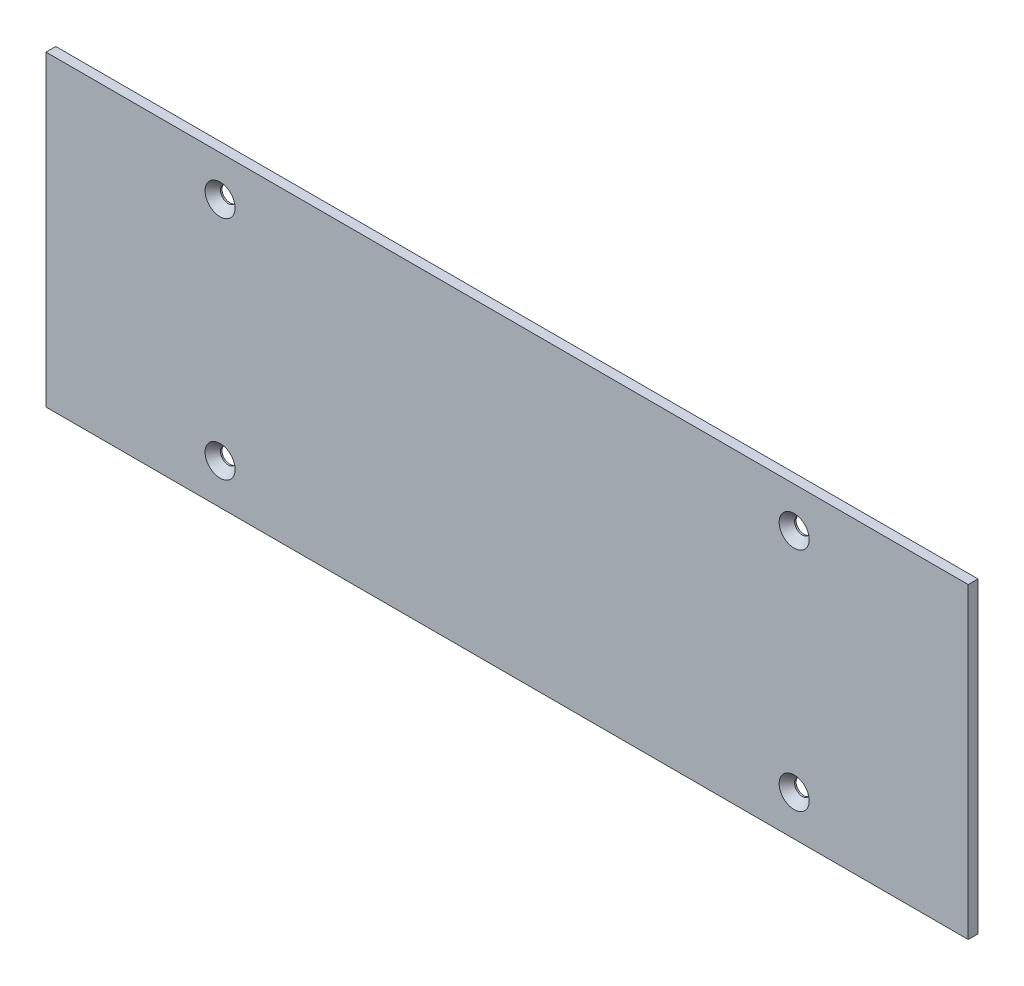
ISO-10303-21;
HEADER;
FILE_DESCRIPTION(('STEP AP214'),'2;1');
FILE_NAME('part.step','',(''),(''),'','','');
FILE_SCHEMA(('AUTOMOTIVE_DESIGN { 1 0 10303 214 1 1 1 1 }'));
ENDSEC;
DATA;
#1=APPLICATION_CONTEXT('core data for automotive mechanical design processes');
#2=APPLICATION_PROTOCOL_DEFINITION('international standard','automotive_design',2000,#1);
#3=PRODUCT_CONTEXT('',#1,'mechanical');
#4=PRODUCT('Part','Part','',(#3));
#5=PRODUCT_RELATED_PRODUCT_CATEGORY('part','',(#4));
#6=PRODUCT_DEFINITION_FORMATION('','',#4);
#7=PRODUCT_DEFINITION_CONTEXT('part definition',#1,'design');
#8=PRODUCT_DEFINITION('design','',#6,#7);
#9=PRODUCT_DEFINITION_SHAPE('','',#8);
#10=(LENGTH_UNIT() NAMED_UNIT(*) SI_UNIT(.MILLI.,.METRE.));
#11=(NAMED_UNIT(*) PLANE_ANGLE_UNIT() SI_UNIT($,.RADIAN.));
#12=(NAMED_UNIT(*) SI_UNIT($,.STERADIAN.) SOLID_ANGLE_UNIT());
#13=UNCERTAINTY_MEASURE_WITH_UNIT(LENGTH_MEASURE(1.E-05),#10,'distance_accuracy_value','');
#14=(GEOMETRIC_REPRESENTATION_CONTEXT(3) GLOBAL_UNCERTAINTY_ASSIGNED_CONTEXT((#13)) GLOBAL_UNIT_ASSIGNED_CONTEXT((#10,
#11,#12)) REPRESENTATION_CONTEXT('',''));
#15=CARTESIAN_POINT('',(0.,0.,0.));
#16=DIRECTION('',(0.,0.,1.));
#17=DIRECTION('',(1.,0.,0.));
#18=AXIS2_PLACEMENT_3D('',#15,#16,#17);
#19=CARTESIAN_POINT('',(149.999999847,-49.999999949,3.175));
#20=DIRECTION('',(-1.,0.,0.));
#21=DIRECTION('',(0.,0.,1.));
#22=AXIS2_PLACEMENT_3D('',#19,#20,#21);
#23=PLANE('',#22);
#24=DIRECTION('',(0.,1.,0.));
#25=VECTOR('',#24,1.);
#26=CARTESIAN_POINT('',(149.999999847,-49.999999949,0.));
#27=LINE('',#26,#25);
#28=CARTESIAN_POINT('',(149.999999847,-49.999999949,0.));
#29=VERTEX_POINT('',#28);
#30=CARTESIAN_POINT('',(149.999999847,49.999999949,0.));
#31=VERTEX_POINT('',#30);
#32=EDGE_CURVE('E105',#29,#31,#27,.T.);
#33=ORIENTED_EDGE('',*,*,#32,.T.);
#34=DIRECTION('',(0.,0.,-1.));
#35=VECTOR('',#34,1.);
#36=CARTESIAN_POINT('',(149.999999847,49.999999949,3.175));
#37=LINE('',#36,#35);
#38=CARTESIAN_POINT('',(149.999999847,49.999999949,3.175));
#39=VERTEX_POINT('',#38);
#40=EDGE_CURVE('E11',#39,#31,#37,.T.);
#41=ORIENTED_EDGE('',*,*,#40,.F.);
#42=DIRECTION('',(0.,1.,0.));
#43=VECTOR('',#42,1.);
#44=CARTESIAN_POINT('',(149.999999847,-49.999999949,3.175));
#45=LINE('',#44,#43);
#46=CARTESIAN_POINT('',(149.999999847,-49.999999949,3.175));
#47=VERTEX_POINT('',#46);
#48=EDGE_CURVE('E92',#47,#39,#45,.T.);
#49=ORIENTED_EDGE('',*,*,#48,.F.);
#50=DIRECTION('',(0.,0.,-1.));
#51=VECTOR('',#50,1.);
#52=CARTESIAN_POINT('',(149.999999847,-49.999999949,3.175));
#53=LINE('',#52,#51);
#54=EDGE_CURVE('E101',#47,#29,#53,.T.);
#55=ORIENTED_EDGE('',*,*,#54,.T.);
#56=EDGE_LOOP('',(#33,#41,#49,#55));
#57=FACE_BOUND('',#56,.T.);
#58=ADVANCED_FACE('F39',(#57),#23,.F.);
#59=CARTESIAN_POINT('',(-149.999999847,49.999999949,3.175));
#60=DIRECTION('',(0.,-1.,0.));
#61=DIRECTION('',(0.,0.,-1.));
#62=AXIS2_PLACEMENT_3D('',#59,#60,#61);
#63=PLANE('',#62);
#64=DIRECTION('',(-1.,0.,0.));
#65=VECTOR('',#64,1.);
#66=CARTESIAN_POINT('',(-149.999999847,49.999999949,0.));
#67=LINE('',#66,#65);
#68=CARTESIAN_POINT('',(-149.999999847,49.999999949,0.));
#69=VERTEX_POINT('',#68);
#70=EDGE_CURVE('E96',#31,#69,#67,.T.);
#71=ORIENTED_EDGE('',*,*,#70,.T.);
#72=DIRECTION('',(0.,0.,-1.));
#73=VECTOR('',#72,1.);
#74=CARTESIAN_POINT('',(-149.999999847,49.999999949,3.175));
#75=LINE('',#74,#73);
#76=CARTESIAN_POINT('',(-149.999999847,49.999999949,3.175));
#77=VERTEX_POINT('',#76);
#78=EDGE_CURVE('E48',#77,#69,#75,.T.);
#79=ORIENTED_EDGE('',*,*,#78,.F.);
#80=DIRECTION('',(-1.,0.,0.));
#81=VECTOR('',#80,1.);
#82=CARTESIAN_POINT('',(-149.999999847,49.999999949,3.175));
#83=LINE('',#82,#81);
#84=EDGE_CURVE('E87',#39,#77,#83,.T.);
#85=ORIENTED_EDGE('',*,*,#84,.F.);
#86=ORIENTED_EDGE('',*,*,#40,.T.);
#87=EDGE_LOOP('',(#71,#79,#85,#86));
#88=FACE_BOUND('',#87,.T.);
#89=ADVANCED_FACE('F95',(#88),#63,.F.);
#90=CARTESIAN_POINT('',(-149.999999847,-49.999999949,3.175));
#91=DIRECTION('',(1.,0.,0.));
#92=DIRECTION('',(0.,0.,-1.));
#93=AXIS2_PLACEMENT_3D('',#90,#91,#92);
#94=PLANE('',#93);
#95=DIRECTION('',(0.,-1.,0.));
#96=VECTOR('',#95,1.);
#97=CARTESIAN_POINT('',(-149.999999847,-49.999999949,0.));
#98=LINE('',#97,#96);
#99=CARTESIAN_POINT('',(-149.999999847,-49.999999949,0.));
#100=VERTEX_POINT('',#99);
#101=EDGE_CURVE('E74',#69,#100,#98,.T.);
#102=ORIENTED_EDGE('',*,*,#101,.T.);
#103=DIRECTION('',(0.,0.,-1.));
#104=VECTOR('',#103,1.);
#105=CARTESIAN_POINT('',(-149.999999847,-49.999999949,3.175));
#106=LINE('',#105,#104);
#107=CARTESIAN_POINT('',(-149.999999847,-49.999999949,3.175));
#108=VERTEX_POINT('',#107);
#109=EDGE_CURVE('E97',#108,#100,#106,.T.);
#110=ORIENTED_EDGE('',*,*,#109,.F.);
#111=DIRECTION('',(0.,-1.,0.));
#112=VECTOR('',#111,1.);
#113=CARTESIAN_POINT('',(-149.999999847,-49.999999949,3.175));
#114=LINE('',#113,#112);
#115=EDGE_CURVE('E90',#77,#108,#114,.T.);
#116=ORIENTED_EDGE('',*,*,#115,.F.);
#117=ORIENTED_EDGE('',*,*,#78,.T.);
#118=EDGE_LOOP('',(#102,#110,#116,#117));
#119=FACE_BOUND('',#118,.T.);
#120=ADVANCED_FACE('F99',(#119),#94,.F.);
#121=CARTESIAN_POINT('',(-149.999999847,-49.999999949,3.175));
#122=DIRECTION('',(0.,1.,0.));
#123=DIRECTION('',(0.,0.,1.));
#124=AXIS2_PLACEMENT_3D('',#121,#122,#123);
#125=PLANE('',#124);
#126=DIRECTION('',(1.,0.,0.));
#127=VECTOR('',#126,1.);
#128=CARTESIAN_POINT('',(-149.999999847,-49.999999949,0.));
#129=LINE('',#128,#127);
#130=EDGE_CURVE('E80',#100,#29,#129,.T.);
#131=ORIENTED_EDGE('',*,*,#130,.T.);
#132=ORIENTED_EDGE('',*,*,#54,.F.);
#133=DIRECTION('',(1.,0.,0.));
#134=VECTOR('',#133,1.);
#135=CARTESIAN_POINT('',(-149.999999847,-49.999999949,3.175));
#136=LINE('',#135,#134);
#137=EDGE_CURVE('E57',#108,#47,#136,.T.);
#138=ORIENTED_EDGE('',*,*,#137,.F.);
#139=ORIENTED_EDGE('',*,*,#109,.T.);
#140=EDGE_LOOP('',(#131,#132,#138,#139));
#141=FACE_BOUND('',#140,.T.);
#142=ADVANCED_FACE('F156',(#141),#125,.F.);
#143=CARTESIAN_POINT('',(0.,0.,3.175));
#144=DIRECTION('',(0.,0.,-1.));
#145=DIRECTION('',(-1.,0.,0.));
#146=AXIS2_PLACEMENT_3D('',#143,#144,#145);
#147=PLANE('',#146);
#148=CARTESIAN_POINT('',(93.3749998470063,36.8249999490018,3.175));
#149=DIRECTION('',(0.,0.,1.));
#150=DIRECTION('',(1.,0.,0.));
#151=AXIS2_PLACEMENT_3D('',#148,#149,#150);
#152=CIRCLE('',#151,4.88950000000001);
#153=CARTESIAN_POINT('',(98.2644998470063,36.8249999490018,3.175));
#154=VERTEX_POINT('',#153);
#155=EDGE_CURVE('E278',#154,#154,#152,.T.);
#156=ORIENTED_EDGE('',*,*,#155,.F.);
#157=EDGE_LOOP('',(#156));
#158=FACE_BOUND('',#157,.T.);
#159=CARTESIAN_POINT('',(-93.3749998469943,36.8249999489999,3.175));
#160=DIRECTION('',(0.,0.,1.));
#161=DIRECTION('',(1.,0.,0.));
#162=AXIS2_PLACEMENT_3D('',#159,#160,#161);
#163=CIRCLE('',#162,4.88950000000001);
#164=CARTESIAN_POINT('',(-88.4854998469943,36.8249999489999,3.175));
#165=VERTEX_POINT('',#164);
#166=EDGE_CURVE('E130',#165,#165,#163,.T.);
#167=ORIENTED_EDGE('',*,*,#166,.F.);
#168=EDGE_LOOP('',(#167));
#169=FACE_BOUND('',#168,.T.);
#170=CARTESIAN_POINT('',(-93.3749998470059,-36.8249999490015,3.175));
#171=DIRECTION('',(0.,0.,1.));
#172=DIRECTION('',(1.,0.,0.));
#173=AXIS2_PLACEMENT_3D('',#170,#171,#172);
#174=CIRCLE('',#173,4.88950000000001);
#175=CARTESIAN_POINT('',(-88.4854998470059,-36.8249999490015,3.175));
#176=VERTEX_POINT('',#175);
#177=EDGE_CURVE('E123',#176,#176,#174,.T.);
#178=ORIENTED_EDGE('',*,*,#177,.F.);
#179=EDGE_LOOP('',(#178));
#180=FACE_BOUND('',#179,.T.);
#181=CARTESIAN_POINT('',(93.3749998469999,-36.8249999489999,3.175));
#182=DIRECTION('',(0.,0.,1.));
#183=DIRECTION('',(1.,0.,0.));
#184=AXIS2_PLACEMENT_3D('',#181,#182,#183);
#185=CIRCLE('',#184,4.88950000000001);
#186=CARTESIAN_POINT('',(98.2644998469999,-36.8249999489999,3.175));
#187=VERTEX_POINT('',#186);
#188=EDGE_CURVE('E119',#187,#187,#185,.T.);
#189=ORIENTED_EDGE('',*,*,#188,.F.);
#190=EDGE_LOOP('',(#189));
#191=FACE_BOUND('',#190,.T.);
#192=ORIENTED_EDGE('',*,*,#48,.T.);
#193=ORIENTED_EDGE('',*,*,#84,.T.);
#194=ORIENTED_EDGE('',*,*,#115,.T.);
#195=ORIENTED_EDGE('',*,*,#137,.T.);
#196=EDGE_LOOP('',(#192,#193,#194,#195));
#197=FACE_BOUND('',#196,.T.);
#198=ADVANCED_FACE('F88',(#158,#169,#180,#191,#197),#147,.F.);
#199=CARTESIAN_POINT('',(0.,0.,0.));
#200=DIRECTION('',(0.,0.,-1.));
#201=DIRECTION('',(-1.,0.,0.));
#202=AXIS2_PLACEMENT_3D('',#199,#200,#201);
#203=PLANE('',#202);
#204=CARTESIAN_POINT('',(93.3749998470063,36.8249999490018,0.));
#205=DIRECTION('',(0.,0.,-1.));
#206=DIRECTION('',(-1.,0.,0.));
#207=AXIS2_PLACEMENT_3D('',#204,#205,#206);
#208=CIRCLE('',#207,2.55270000000001);
#209=CARTESIAN_POINT('',(90.8222998470062,36.8249999490018,0.));
#210=VERTEX_POINT('',#209);
#211=EDGE_CURVE('E42',#210,#210,#208,.T.);
#212=ORIENTED_EDGE('',*,*,#211,.F.);
#213=EDGE_LOOP('',(#212));
#214=FACE_BOUND('',#213,.T.);
#215=CARTESIAN_POINT('',(-93.3749998469943,36.8249999489999,0.));
#216=DIRECTION('',(0.,0.,-1.));
#217=DIRECTION('',(-1.,0.,0.));
#218=AXIS2_PLACEMENT_3D('',#215,#216,#217);
#219=CIRCLE('',#218,2.55270000000001);
#220=CARTESIAN_POINT('',(-95.9276998469943,36.8249999489999,0.));
#221=VERTEX_POINT('',#220);
#222=EDGE_CURVE('E121',#221,#221,#219,.T.);
#223=ORIENTED_EDGE('',*,*,#222,.F.);
#224=EDGE_LOOP('',(#223));
#225=FACE_BOUND('',#224,.T.);
#226=CARTESIAN_POINT('',(-93.3749998470059,-36.8249999490015,0.));
#227=DIRECTION('',(0.,0.,-1.));
#228=DIRECTION('',(-1.,0.,0.));
#229=AXIS2_PLACEMENT_3D('',#226,#227,#228);
#230=CIRCLE('',#229,2.55270000000001);
#231=CARTESIAN_POINT('',(-95.9276998470059,-36.8249999490015,0.));
#232=VERTEX_POINT('',#231);
#233=EDGE_CURVE('E117',#232,#232,#230,.T.);
#234=ORIENTED_EDGE('',*,*,#233,.F.);
#235=EDGE_LOOP('',(#234));
#236=FACE_BOUND('',#235,.T.);
#237=CARTESIAN_POINT('',(93.3749998469999,-36.8249999489999,0.));
#238=DIRECTION('',(0.,0.,-1.));
#239=DIRECTION('',(-1.,0.,0.));
#240=AXIS2_PLACEMENT_3D('',#237,#238,#239);
#241=CIRCLE('',#240,2.55270000000001);
#242=CARTESIAN_POINT('',(90.8222998469999,-36.8249999489999,0.));
#243=VERTEX_POINT('',#242);
#244=EDGE_CURVE('E108',#243,#243,#241,.T.);
#245=ORIENTED_EDGE('',*,*,#244,.F.);
#246=EDGE_LOOP('',(#245));
#247=FACE_BOUND('',#246,.T.);
#248=ORIENTED_EDGE('',*,*,#32,.F.);
#249=ORIENTED_EDGE('',*,*,#130,.F.);
#250=ORIENTED_EDGE('',*,*,#101,.F.);
#251=ORIENTED_EDGE('',*,*,#70,.F.);
#252=EDGE_LOOP('',(#248,#249,#250,#251));
#253=FACE_BOUND('',#252,.T.);
#254=ADVANCED_FACE('F155',(#214,#225,#236,#247,#253),#203,.T.);
#255=CARTESIAN_POINT('',(93.3749998469999,-36.8249999489999,3.175));
#256=DIRECTION('',(0.,0.,1.));
#257=DIRECTION('',(1.,0.,0.));
#258=AXIS2_PLACEMENT_3D('',#255,#256,#257);
#259=CYLINDRICAL_SURFACE('',#258,2.55270000000001);
#260=ORIENTED_EDGE('',*,*,#244,.T.);
#261=EDGE_LOOP('',(#260));
#262=FACE_BOUND('',#261,.T.);
#263=CARTESIAN_POINT('',(93.3749998469999,-36.8249999489999,0.486819106005946));
#264=DIRECTION('',(0.,0.,1.));
#265=DIRECTION('',(1.,0.,0.));
#266=AXIS2_PLACEMENT_3D('',#263,#264,#265);
#267=CIRCLE('',#266,2.55270000000001);
#268=CARTESIAN_POINT('',(95.9276998469999,-36.8249999489999,0.486819106005946));
#269=VERTEX_POINT('',#268);
#270=EDGE_CURVE('E116',#269,#269,#267,.T.);
#271=ORIENTED_EDGE('',*,*,#270,.T.);
#272=EDGE_LOOP('',(#271));
#273=FACE_BOUND('',#272,.T.);
#274=ADVANCED_FACE('F145',(#262,#273),#259,.F.);
#275=CARTESIAN_POINT('',(93.3749998469999,-36.8249999489999,3.175));
#276=DIRECTION('',(0.,0.,1.));
#277=DIRECTION('',(1.,0.,0.));
#278=AXIS2_PLACEMENT_3D('',#275,#276,#277);
#279=CONICAL_SURFACE('',#278,4.88950000000001,0.715584993317675);
#280=ORIENTED_EDGE('',*,*,#270,.F.);
#281=EDGE_LOOP('',(#280));
#282=FACE_BOUND('',#281,.T.);
#283=ORIENTED_EDGE('',*,*,#188,.T.);
#284=EDGE_LOOP('',(#283));
#285=FACE_BOUND('',#284,.T.);
#286=ADVANCED_FACE('F147',(#282,#285),#279,.F.);
#287=CARTESIAN_POINT('',(-93.3749998470059,-36.8249999490015,3.175));
#288=DIRECTION('',(0.,0.,1.));
#289=DIRECTION('',(1.,0.,0.));
#290=AXIS2_PLACEMENT_3D('',#287,#288,#289);
#291=CYLINDRICAL_SURFACE('',#290,2.55270000000001);
#292=ORIENTED_EDGE('',*,*,#233,.T.);
#293=EDGE_LOOP('',(#292));
#294=FACE_BOUND('',#293,.T.);
#295=CARTESIAN_POINT('',(-93.3749998470059,-36.8249999490015,0.486819106005946));
#296=DIRECTION('',(0.,0.,1.));
#297=DIRECTION('',(1.,0.,0.));
#298=AXIS2_PLACEMENT_3D('',#295,#296,#297);
#299=CIRCLE('',#298,2.55270000000001);
#300=CARTESIAN_POINT('',(-90.8222998470059,-36.8249999490015,0.486819106005946));
#301=VERTEX_POINT('',#300);
#302=EDGE_CURVE('E120',#301,#301,#299,.T.);
#303=ORIENTED_EDGE('',*,*,#302,.T.);
#304=EDGE_LOOP('',(#303));
#305=FACE_BOUND('',#304,.T.);
#306=ADVANCED_FACE('F150',(#294,#305),#291,.F.);
#307=CARTESIAN_POINT('',(-93.3749998470059,-36.8249999490015,3.175));
#308=DIRECTION('',(0.,0.,1.));
#309=DIRECTION('',(1.,0.,0.));
#310=AXIS2_PLACEMENT_3D('',#307,#308,#309);
#311=CONICAL_SURFACE('',#310,4.88950000000001,0.715584993317675);
#312=ORIENTED_EDGE('',*,*,#302,.F.);
#313=EDGE_LOOP('',(#312));
#314=FACE_BOUND('',#313,.T.);
#315=ORIENTED_EDGE('',*,*,#177,.T.);
#316=EDGE_LOOP('',(#315));
#317=FACE_BOUND('',#316,.T.);
#318=ADVANCED_FACE('F221',(#314,#317),#311,.F.);
#319=CARTESIAN_POINT('',(-93.3749998469943,36.8249999489999,3.175));
#320=DIRECTION('',(0.,0.,1.));
#321=DIRECTION('',(1.,0.,0.));
#322=AXIS2_PLACEMENT_3D('',#319,#320,#321);
#323=CYLINDRICAL_SURFACE('',#322,2.55270000000001);
#324=ORIENTED_EDGE('',*,*,#222,.T.);
#325=EDGE_LOOP('',(#324));
#326=FACE_BOUND('',#325,.T.);
#327=CARTESIAN_POINT('',(-93.3749998469943,36.8249999489999,0.486819106005946));
#328=DIRECTION('',(0.,0.,1.));
#329=DIRECTION('',(1.,0.,0.));
#330=AXIS2_PLACEMENT_3D('',#327,#328,#329);
#331=CIRCLE('',#330,2.55270000000001);
#332=CARTESIAN_POINT('',(-90.8222998469943,36.8249999489999,0.486819106005946));
#333=VERTEX_POINT('',#332);
#334=EDGE_CURVE('E124',#333,#333,#331,.T.);
#335=ORIENTED_EDGE('',*,*,#334,.T.);
#336=EDGE_LOOP('',(#335));
#337=FACE_BOUND('',#336,.T.);
#338=ADVANCED_FACE('F231',(#326,#337),#323,.F.);
#339=CARTESIAN_POINT('',(-93.3749998469943,36.8249999489999,3.175));
#340=DIRECTION('',(0.,0.,1.));
#341=DIRECTION('',(1.,0.,0.));
#342=AXIS2_PLACEMENT_3D('',#339,#340,#341);
#343=CONICAL_SURFACE('',#342,4.88950000000001,0.715584993317675);
#344=ORIENTED_EDGE('',*,*,#334,.F.);
#345=EDGE_LOOP('',(#344));
#346=FACE_BOUND('',#345,.T.);
#347=ORIENTED_EDGE('',*,*,#166,.T.);
#348=EDGE_LOOP('',(#347));
#349=FACE_BOUND('',#348,.T.);
#350=ADVANCED_FACE('F241',(#346,#349),#343,.F.);
#351=CARTESIAN_POINT('',(93.3749998470063,36.8249999490018,3.175));
#352=DIRECTION('',(0.,0.,1.));
#353=DIRECTION('',(1.,0.,0.));
#354=AXIS2_PLACEMENT_3D('',#351,#352,#353);
#355=CYLINDRICAL_SURFACE('',#354,2.55270000000001);
#356=ORIENTED_EDGE('',*,*,#211,.T.);
#357=EDGE_LOOP('',(#356));
#358=FACE_BOUND('',#357,.T.);
#359=CARTESIAN_POINT('',(93.3749998470063,36.8249999490018,0.486819106005946));
#360=DIRECTION('',(0.,0.,1.));
#361=DIRECTION('',(1.,0.,0.));
#362=AXIS2_PLACEMENT_3D('',#359,#360,#361);
#363=CIRCLE('',#362,2.55270000000001);
#364=CARTESIAN_POINT('',(95.9276998470063,36.8249999490018,0.486819106005946));
#365=VERTEX_POINT('',#364);
#366=EDGE_CURVE('E276',#365,#365,#363,.T.);
#367=ORIENTED_EDGE('',*,*,#366,.T.);
#368=EDGE_LOOP('',(#367));
#369=FACE_BOUND('',#368,.T.);
#370=ADVANCED_FACE('F250',(#358,#369),#355,.F.);
#371=CARTESIAN_POINT('',(93.3749998470063,36.8249999490018,3.175));
#372=DIRECTION('',(0.,0.,1.));
#373=DIRECTION('',(1.,0.,0.));
#374=AXIS2_PLACEMENT_3D('',#371,#372,#373);
#375=CONICAL_SURFACE('',#374,4.88950000000001,0.715584993317675);
#376=ORIENTED_EDGE('',*,*,#366,.F.);
#377=EDGE_LOOP('',(#376));
#378=FACE_BOUND('',#377,.T.);
#379=ORIENTED_EDGE('',*,*,#155,.T.);
#380=EDGE_LOOP('',(#379));
#381=FACE_BOUND('',#380,.T.);
#382=ADVANCED_FACE('F260',(#378,#381),#375,.F.);
#383=CLOSED_SHELL('',(#58,#89,#120,#142,#198,#254,#274,#286,#306,#318,#338,#350,#370,#382));
#384=MANIFOLD_SOLID_BREP('B2',#383);
#385=ADVANCED_BREP_SHAPE_REPRESENTATION('',(#18,#384),#14);
#386=SHAPE_DEFINITION_REPRESENTATION(#9,#385);
ENDSEC;
END-ISO-10303-21;
